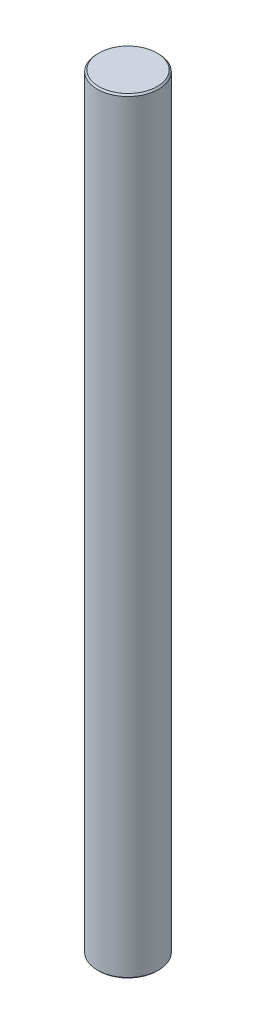
ISO-10303-21;
HEADER;
FILE_DESCRIPTION(('STEP AP214'),'2;1');
FILE_NAME('part.step','',(''),(''),'','','');
FILE_SCHEMA(('AUTOMOTIVE_DESIGN { 1 0 10303 214 1 1 1 1 }'));
ENDSEC;
DATA;
#1=APPLICATION_CONTEXT('core data for automotive mechanical design processes');
#2=APPLICATION_PROTOCOL_DEFINITION('international standard','automotive_design',2000,#1);
#3=PRODUCT_CONTEXT('',#1,'mechanical');
#4=PRODUCT('Part','Part','',(#3));
#5=PRODUCT_RELATED_PRODUCT_CATEGORY('part','',(#4));
#6=PRODUCT_DEFINITION_FORMATION('','',#4);
#7=PRODUCT_DEFINITION_CONTEXT('part definition',#1,'design');
#8=PRODUCT_DEFINITION('design','',#6,#7);
#9=PRODUCT_DEFINITION_SHAPE('','',#8);
#10=(LENGTH_UNIT() NAMED_UNIT(*) SI_UNIT(.MILLI.,.METRE.));
#11=(NAMED_UNIT(*) PLANE_ANGLE_UNIT() SI_UNIT($,.RADIAN.));
#12=(NAMED_UNIT(*) SI_UNIT($,.STERADIAN.) SOLID_ANGLE_UNIT());
#13=UNCERTAINTY_MEASURE_WITH_UNIT(LENGTH_MEASURE(1.E-05),#10,'distance_accuracy_value','');
#14=(GEOMETRIC_REPRESENTATION_CONTEXT(3) GLOBAL_UNCERTAINTY_ASSIGNED_CONTEXT((#13)) GLOBAL_UNIT_ASSIGNED_CONTEXT((#10,
#11,#12)) REPRESENTATION_CONTEXT('',''));
#15=CARTESIAN_POINT('',(0.,0.,0.));
#16=DIRECTION('',(0.,0.,1.));
#17=DIRECTION('',(1.,0.,0.));
#18=AXIS2_PLACEMENT_3D('',#15,#16,#17);
#19=CARTESIAN_POINT('',(0.,100.,0.));
#20=DIRECTION('',(0.,-1.,0.));
#21=DIRECTION('',(0.,0.,-1.));
#22=AXIS2_PLACEMENT_3D('',#19,#20,#21);
#23=CYLINDRICAL_SURFACE('',#22,4.);
#24=CARTESIAN_POINT('',(0.,0.20000000000002,0.));
#25=DIRECTION('',(0.,1.,0.));
#26=DIRECTION('',(0.,0.,1.));
#27=AXIS2_PLACEMENT_3D('',#24,#25,#26);
#28=CIRCLE('',#27,4.);
#29=CARTESIAN_POINT('',(0.,0.20000000000002,4.));
#30=VERTEX_POINT('',#29);
#31=EDGE_CURVE('E50',#30,#30,#28,.T.);
#32=ORIENTED_EDGE('',*,*,#31,.T.);
#33=EDGE_LOOP('',(#32));
#34=FACE_BOUND('',#33,.T.);
#35=CARTESIAN_POINT('',(0.,99.8,0.));
#36=DIRECTION('',(0.,1.,0.));
#37=DIRECTION('',(0.,0.,1.));
#38=AXIS2_PLACEMENT_3D('',#35,#36,#37);
#39=CIRCLE('',#38,4.);
#40=CARTESIAN_POINT('',(0.,99.8,4.));
#41=VERTEX_POINT('',#40);
#42=EDGE_CURVE('E55',#41,#41,#39,.F.);
#43=ORIENTED_EDGE('',*,*,#42,.T.);
#44=EDGE_LOOP('',(#43));
#45=FACE_BOUND('',#44,.T.);
#46=ADVANCED_FACE('F37',(#34,#45),#23,.T.);
#47=CARTESIAN_POINT('',(0.,100.,0.));
#48=DIRECTION('',(0.,1.,0.));
#49=DIRECTION('',(0.,0.,1.));
#50=AXIS2_PLACEMENT_3D('',#47,#48,#49);
#51=PLANE('',#50);
#52=CARTESIAN_POINT('',(0.,100.,0.));
#53=DIRECTION('',(0.,1.,0.));
#54=DIRECTION('',(0.,0.,1.));
#55=AXIS2_PLACEMENT_3D('',#52,#53,#54);
#56=CIRCLE('',#55,3.8);
#57=CARTESIAN_POINT('',(0.,100.,3.8));
#58=VERTEX_POINT('',#57);
#59=EDGE_CURVE('E10',#58,#58,#56,.T.);
#60=ORIENTED_EDGE('',*,*,#59,.T.);
#61=EDGE_LOOP('',(#60));
#62=FACE_BOUND('',#61,.T.);
#63=ADVANCED_FACE('F72',(#62),#51,.T.);
#64=CARTESIAN_POINT('',(0.,0.,0.));
#65=DIRECTION('',(0.,1.,0.));
#66=DIRECTION('',(0.,0.,1.));
#67=AXIS2_PLACEMENT_3D('',#64,#65,#66);
#68=PLANE('',#67);
#69=CARTESIAN_POINT('',(0.,0.,0.));
#70=DIRECTION('',(0.,1.,0.));
#71=DIRECTION('',(0.,0.,1.));
#72=AXIS2_PLACEMENT_3D('',#69,#70,#71);
#73=CIRCLE('',#72,3.79999999999998);
#74=CARTESIAN_POINT('',(0.,0.,3.79999999999998));
#75=VERTEX_POINT('',#74);
#76=EDGE_CURVE('E45',#75,#75,#73,.F.);
#77=ORIENTED_EDGE('',*,*,#76,.T.);
#78=EDGE_LOOP('',(#77));
#79=FACE_BOUND('',#78,.T.);
#80=ADVANCED_FACE('F69',(#79),#68,.F.);
#81=CARTESIAN_POINT('',(0.,0.20000000000002,0.));
#82=DIRECTION('',(0.,1.,0.));
#83=DIRECTION('',(0.,0.,1.));
#84=AXIS2_PLACEMENT_3D('',#81,#82,#83);
#85=CONICAL_SURFACE('',#84,4.,0.78539816339744);
#86=ORIENTED_EDGE('',*,*,#76,.F.);
#87=EDGE_LOOP('',(#86));
#88=FACE_BOUND('',#87,.T.);
#89=ORIENTED_EDGE('',*,*,#31,.F.);
#90=EDGE_LOOP('',(#89));
#91=FACE_BOUND('',#90,.T.);
#92=ADVANCED_FACE('F65',(#88,#91),#85,.T.);
#93=CARTESIAN_POINT('',(0.,100.,0.));
#94=DIRECTION('',(0.,-1.,0.));
#95=DIRECTION('',(0.,0.,-1.));
#96=AXIS2_PLACEMENT_3D('',#93,#94,#95);
#97=CONICAL_SURFACE('',#96,3.8,0.78539816339744);
#98=ORIENTED_EDGE('',*,*,#42,.F.);
#99=EDGE_LOOP('',(#98));
#100=FACE_BOUND('',#99,.T.);
#101=ORIENTED_EDGE('',*,*,#59,.F.);
#102=EDGE_LOOP('',(#101));
#103=FACE_BOUND('',#102,.T.);
#104=ADVANCED_FACE('F39',(#100,#103),#97,.T.);
#105=CLOSED_SHELL('',(#46,#63,#80,#92,#104));
#106=MANIFOLD_SOLID_BREP('B2',#105);
#107=ADVANCED_BREP_SHAPE_REPRESENTATION('',(#18,#106),#14);
#108=SHAPE_DEFINITION_REPRESENTATION(#9,#107);
ENDSEC;
END-ISO-10303-21;
